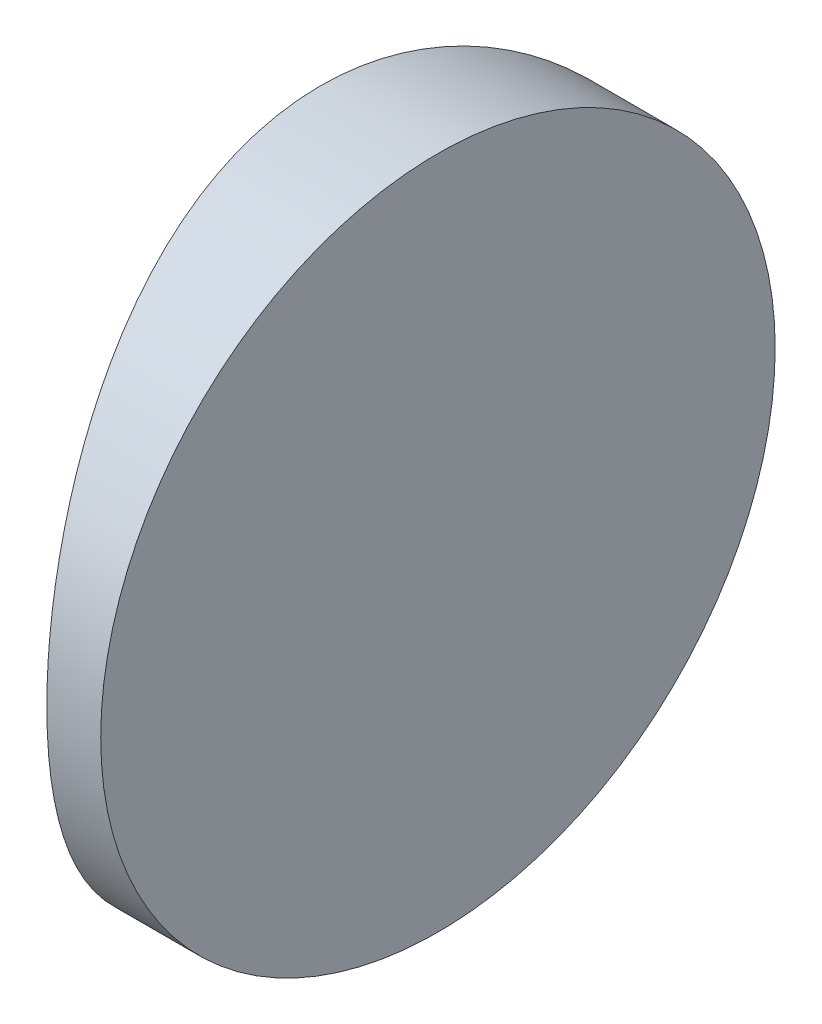
ISO-10303-21;
HEADER;
FILE_DESCRIPTION(('STEP AP214'),'2;1');
FILE_NAME('part.step','',(''),(''),'','','');
FILE_SCHEMA(('AUTOMOTIVE_DESIGN { 1 0 10303 214 1 1 1 1 }'));
ENDSEC;
DATA;
#1=APPLICATION_CONTEXT('core data for automotive mechanical design processes');
#2=APPLICATION_PROTOCOL_DEFINITION('international standard','automotive_design',2000,#1);
#3=PRODUCT_CONTEXT('',#1,'mechanical');
#4=PRODUCT('Part','Part','',(#3));
#5=PRODUCT_RELATED_PRODUCT_CATEGORY('part','',(#4));
#6=PRODUCT_DEFINITION_FORMATION('','',#4);
#7=PRODUCT_DEFINITION_CONTEXT('part definition',#1,'design');
#8=PRODUCT_DEFINITION('design','',#6,#7);
#9=PRODUCT_DEFINITION_SHAPE('','',#8);
#10=(LENGTH_UNIT() NAMED_UNIT(*) SI_UNIT(.MILLI.,.METRE.));
#11=(NAMED_UNIT(*) PLANE_ANGLE_UNIT() SI_UNIT($,.RADIAN.));
#12=(NAMED_UNIT(*) SI_UNIT($,.STERADIAN.) SOLID_ANGLE_UNIT());
#13=UNCERTAINTY_MEASURE_WITH_UNIT(LENGTH_MEASURE(1.E-05),#10,'distance_accuracy_value','');
#14=(GEOMETRIC_REPRESENTATION_CONTEXT(3) GLOBAL_UNCERTAINTY_ASSIGNED_CONTEXT((#13)) GLOBAL_UNIT_ASSIGNED_CONTEXT((#10,
#11,#12)) REPRESENTATION_CONTEXT('',''));
#15=CARTESIAN_POINT('',(0.,0.,0.));
#16=DIRECTION('',(0.,0.,1.));
#17=DIRECTION('',(1.,0.,0.));
#18=AXIS2_PLACEMENT_3D('',#15,#16,#17);
#19=CARTESIAN_POINT('',(4.35520433485127,25.,0.));
#20=DIRECTION('',(0.,-1.,0.));
#21=DIRECTION('',(0.,0.,-1.));
#22=AXIS2_PLACEMENT_3D('',#19,#20,#21);
#23=CYLINDRICAL_SURFACE('',#22,34.39);
#24=CARTESIAN_POINT('',(-30.0347956651487,0.,0.));
#25=CARTESIAN_POINT('',(-30.0347941738012,2.05808691288381E-06,-0.338969365276716));
#26=CARTESIAN_POINT('',(-30.02977143855,0.0138022747202658,-0.677981251628454));
#27=CARTESIAN_POINT('',(-30.0098124018236,0.068873026789289,-1.35350339835082));
#28=CARTESIAN_POINT('',(-29.9948744297759,0.110148191355304,-1.69001322749849));
#29=CARTESIAN_POINT('',(-29.9554754838055,0.219801766105438,-2.35827418334867));
#30=CARTESIAN_POINT('',(-29.9310075652602,0.28819994191662,-2.69002165643485));
#31=CARTESIAN_POINT('',(-29.8732045955471,0.451444175512813,-3.34613046644533));
#32=CARTESIAN_POINT('',(-29.8398698661614,0.546289273528378,-3.67049207094381));
#33=CARTESIAN_POINT('',(-29.7652923573491,0.761331644796709,-4.30892983814302));
#34=CARTESIAN_POINT('',(-29.7240675282049,0.881471432571458,-4.62302748831512));
#35=CARTESIAN_POINT('',(-29.6347161111766,1.14622912634876,-5.23970328918754));
#36=CARTESIAN_POINT('',(-29.5865894736583,1.29084720838819,-5.54228135702505));
#37=CARTESIAN_POINT('',(-29.4846490443849,1.6034228674638,-6.1340495959587));
#38=CARTESIAN_POINT('',(-29.4308362577773,1.77137632112526,-6.4232421202796));
#39=CARTESIAN_POINT('',(-29.3188191212244,2.12952792923171,-6.9867600635451));
#40=CARTESIAN_POINT('',(-29.2606130718088,2.31973470786717,-7.26107965787024));
#41=CARTESIAN_POINT('',(-29.1390989435598,2.72832440355008,-7.80279094983721));
#42=CARTESIAN_POINT('',(-29.0756827269485,2.94747356927273,-8.06958063635612));
#43=CARTESIAN_POINT('',(-28.9472968399626,3.40697185225098,-8.58404643079141));
#44=CARTESIAN_POINT('',(-28.8823264725477,3.64733061711824,-8.83171374347192));
#45=CARTESIAN_POINT('',(-28.7525340809389,4.1478343613551,-9.30646841225841));
#46=CARTESIAN_POINT('',(-28.6877121374308,4.40798826908987,-9.53354637936853));
#47=CARTESIAN_POINT('',(-28.5600091467937,4.94635715716218,-9.96551752073312));
#48=CARTESIAN_POINT('',(-28.4971272586666,5.22456414460021,-10.1704204071195));
#49=CARTESIAN_POINT('',(-28.372789943311,5.80794350109248,-10.5638341865828));
#50=CARTESIAN_POINT('',(-28.3114688618502,6.1137277904784,-10.7514815842722));
#51=CARTESIAN_POINT('',(-28.1946479565188,6.74103459297039,-11.1001362795243));
#52=CARTESIAN_POINT('',(-28.1391458232706,7.06255078764978,-11.2611541603603));
#53=CARTESIAN_POINT('',(-28.0357680589081,7.71900105427024,-11.5551408353397));
#54=CARTESIAN_POINT('',(-27.98788574424,8.05392304123946,-11.6881342440916));
#55=CARTESIAN_POINT('',(-27.9013167412682,8.73502578119687,-11.9249688682733));
#56=CARTESIAN_POINT('',(-27.8626276283538,9.08120353815058,-12.0288177715732));
#57=CARTESIAN_POINT('',(-27.8054007548305,9.68143100554807,-12.1808088297934));
#58=CARTESIAN_POINT('',(-27.7842668773496,9.9333793917823,-12.2363838686093));
#59=CARTESIAN_POINT('',(-27.747742080805,10.4406263719365,-12.3318919628501));
#60=CARTESIAN_POINT('',(-27.732350559544,10.695924611651,-12.37182665849));
#61=CARTESIAN_POINT('',(-27.7076039957435,11.2088044958382,-12.435819302021));
#62=CARTESIAN_POINT('',(-27.6982491686427,11.4663862214718,-12.4598766832805));
#63=CARTESIAN_POINT('',(-27.685756339863,11.9826370420057,-12.4919663580624));
#64=CARTESIAN_POINT('',(-27.6826171850375,12.2413059262884,-12.5000016240484));
#65=CARTESIAN_POINT('',(-27.6826205069228,12.8381375291856,-12.4999978772157));
#66=CARTESIAN_POINT('',(-27.687988080227,13.1763180943923,-12.4862647655251));
#67=CARTESIAN_POINT('',(-27.7092859809318,13.850153005475,-12.4314681749981));
#68=CARTESIAN_POINT('',(-27.7252181196198,14.1858069081745,-12.3904000095811));
#69=CARTESIAN_POINT('',(-27.7671379407654,14.8523361122904,-12.2813125577776));
#70=CARTESIAN_POINT('',(-27.7931334617728,15.1832074795858,-12.2132722613178));
#71=CARTESIAN_POINT('',(-27.8543463007269,15.837540268571,-12.0509111486494));
#72=CARTESIAN_POINT('',(-27.8895633054551,16.1610019415342,-11.9565912250526));
#73=CARTESIAN_POINT('',(-27.9680273574752,16.797524204096,-11.7428151462785));
#74=CARTESIAN_POINT('',(-28.0112528401626,17.1106101248843,-11.6234263820394));
#75=CARTESIAN_POINT('',(-28.1045235765738,17.725337864961,-11.3603532710375));
#76=CARTESIAN_POINT('',(-28.1545688777051,18.0269796046778,-11.2166687553834));
#77=CARTESIAN_POINT('',(-28.2600651870949,18.6170227642194,-10.9061070386771));
#78=CARTESIAN_POINT('',(-28.3155154348455,18.9054260383991,-10.7392330991118));
#79=CARTESIAN_POINT('',(-28.4303590918275,19.4675545532789,-10.3833470017479));
#80=CARTESIAN_POINT('',(-28.4897540285481,19.741274032978,-10.1943262462034));
#81=CARTESIAN_POINT('',(-28.6134801873845,20.2836156031544,-9.78698716485049));
#82=CARTESIAN_POINT('',(-28.6779139612507,20.5515409938053,-9.56777188441143));
#83=CARTESIAN_POINT('',(-28.8076564014561,21.0683037733915,-9.1079010604703));
#84=CARTESIAN_POINT('',(-28.8729654553541,21.3171323549605,-8.86723573357761));
#85=CARTESIAN_POINT('',(-29.0027213743524,21.7941821692289,-8.36588024178535));
#86=CARTESIAN_POINT('',(-29.0671679029777,22.0223955486004,-8.10518251498056));
#87=CARTESIAN_POINT('',(-29.1934522715714,22.4565752778307,-7.56548101808777));
#88=CARTESIAN_POINT('',(-29.2552912656805,22.6625515345815,-7.28648548967727));
#89=CARTESIAN_POINT('',(-29.3767191021934,23.0573190959903,-6.70233462666185));
#90=CARTESIAN_POINT('',(-29.4361688688446,23.2453312639972,-6.39662298665111));
#91=CARTESIAN_POINT('',(-29.5488889743554,23.5947187906965,-5.76940404096194));
#92=CARTESIAN_POINT('',(-29.6021617667492,23.7561047363448,-5.44790307964174));
#93=CARTESIAN_POINT('',(-29.7009854254112,24.0508104644883,-4.79146306772125));
#94=CARTESIAN_POINT('',(-29.7465426456443,24.1841533632267,-4.45653535829633));
#95=CARTESIAN_POINT('',(-29.8286445052507,24.4216551711053,-3.77546339493251));
#96=CARTESIAN_POINT('',(-29.8651914294287,24.5258214796745,-3.42932200976544));
#97=CARTESIAN_POINT('',(-29.9192239767809,24.6785814276123,-2.82826750935797));
#98=CARTESIAN_POINT('',(-29.9391743184519,24.734554021432,-2.57542308425451));
#99=CARTESIAN_POINT('',(-29.9736050265767,24.8307372103584,-2.06639409243557));
#100=CARTESIAN_POINT('',(-29.9880859410891,24.870949384738,-1.81020986304474));
#101=CARTESIAN_POINT('',(-30.011348655705,24.9353837118965,-1.29556512868129));
#102=CARTESIAN_POINT('',(-30.0201301201079,24.9596049228008,-1.03710449053563));
#103=CARTESIAN_POINT('',(-30.0318536561941,24.9919123637648,-0.519104073687481));
#104=CARTESIAN_POINT('',(-30.0347968071425,25.0000015759722,-0.259564503326491));
#105=CARTESIAN_POINT('',(-30.0347941738012,24.9999979419131,0.338969365276735));
#106=CARTESIAN_POINT('',(-30.02977143855,24.9861977252797,0.677981251628475));
#107=CARTESIAN_POINT('',(-30.0098124018236,24.9311269732107,1.35350339835084));
#108=CARTESIAN_POINT('',(-29.9948744297758,24.8898518086447,1.69001322749851));
#109=CARTESIAN_POINT('',(-29.9554754838055,24.7801982338946,2.35827418334869));
#110=CARTESIAN_POINT('',(-29.9310075652602,24.7118000580834,2.69002165643487));
#111=CARTESIAN_POINT('',(-29.8732045955471,24.5485558244872,3.34613046644536));
#112=CARTESIAN_POINT('',(-29.8398698661614,24.4537107264716,3.67049207094383));
#113=CARTESIAN_POINT('',(-29.7652923573491,24.2386683552033,4.30892983814303));
#114=CARTESIAN_POINT('',(-29.7240675282049,24.1185285674285,4.62302748831514));
#115=CARTESIAN_POINT('',(-29.6347161111766,23.8537708736512,5.23970328918756));
#116=CARTESIAN_POINT('',(-29.5865894736583,23.7091527916118,5.54228135702507));
#117=CARTESIAN_POINT('',(-29.4846490443849,23.3965771325362,6.13404959595872));
#118=CARTESIAN_POINT('',(-29.4308362577773,23.2286236788747,6.42324212027962));
#119=CARTESIAN_POINT('',(-29.3188191212244,22.8704720707683,6.98676006354512));
#120=CARTESIAN_POINT('',(-29.2606130718088,22.6802652921328,7.26107965787026));
#121=CARTESIAN_POINT('',(-29.1390989435598,22.2716755964499,7.80279094983723));
#122=CARTESIAN_POINT('',(-29.0756827269485,22.0525264307273,8.06958063635614));
#123=CARTESIAN_POINT('',(-28.9472968399626,21.593028147749,8.58404643079143));
#124=CARTESIAN_POINT('',(-28.8823264725477,21.3526693828818,8.83171374347194));
#125=CARTESIAN_POINT('',(-28.7525340809389,20.8521656386449,9.30646841225843));
#126=CARTESIAN_POINT('',(-28.6877121374308,20.5920117309101,9.53354637936855));
#127=CARTESIAN_POINT('',(-28.5600091467937,20.0536428428378,9.96551752073314));
#128=CARTESIAN_POINT('',(-28.4971272586666,19.7754358553998,10.1704204071195));
#129=CARTESIAN_POINT('',(-28.372789943311,19.1920564989075,10.5638341865828));
#130=CARTESIAN_POINT('',(-28.3114688618502,18.8862722095216,10.7514815842722));
#131=CARTESIAN_POINT('',(-28.1946479565188,18.2589654070296,11.1001362795243));
#132=CARTESIAN_POINT('',(-28.1391458232705,17.9374492123502,11.2611541603603));
#133=CARTESIAN_POINT('',(-28.0357680589081,17.2809989457297,11.5551408353397));
#134=CARTESIAN_POINT('',(-27.98788574424,16.9460769587605,11.6881342440916));
#135=CARTESIAN_POINT('',(-27.9013167412682,16.2649742188031,11.9249688682733));
#136=CARTESIAN_POINT('',(-27.8626276283538,15.9187964618494,12.0288177715732));
#137=CARTESIAN_POINT('',(-27.8054007548305,15.3185689944519,12.1808088297934));
#138=CARTESIAN_POINT('',(-27.7842668773496,15.0666206082177,12.2363838686093));
#139=CARTESIAN_POINT('',(-27.747742080805,14.5593736280635,12.3318919628501));
#140=CARTESIAN_POINT('',(-27.7323505595439,14.304075388349,12.37182665849));
#141=CARTESIAN_POINT('',(-27.7076039957435,13.7911955041618,12.435819302021));
#142=CARTESIAN_POINT('',(-27.6982491686426,13.5336137785282,12.4598766832805));
#143=CARTESIAN_POINT('',(-27.6857563398629,13.0173629579943,12.4919663580624));
#144=CARTESIAN_POINT('',(-27.6826171850375,12.7586940737116,12.5000016240485));
#145=CARTESIAN_POINT('',(-27.6826205069228,12.1618624708144,12.4999978772157));
#146=CARTESIAN_POINT('',(-27.687988080227,11.8236819056077,12.4862647655251));
#147=CARTESIAN_POINT('',(-27.7092859809318,11.149846994525,12.4314681749981));
#148=CARTESIAN_POINT('',(-27.7252181196198,10.8141930918255,12.3904000095811));
#149=CARTESIAN_POINT('',(-27.7671379407654,10.1476638877096,12.2813125577776));
#150=CARTESIAN_POINT('',(-27.7931334617728,9.81679252041423,12.2132722613178));
#151=CARTESIAN_POINT('',(-27.8543463007269,9.16245973142898,12.0509111486494));
#152=CARTESIAN_POINT('',(-27.8895633054551,8.8389980584658,11.9565912250526));
#153=CARTESIAN_POINT('',(-27.9680273574752,8.20247579590404,11.7428151462785));
#154=CARTESIAN_POINT('',(-28.0112528401626,7.88938987511573,11.6234263820395));
#155=CARTESIAN_POINT('',(-28.1045235765738,7.27466213503898,11.3603532710375));
#156=CARTESIAN_POINT('',(-28.1545688777051,6.97302039532227,11.2166687553834));
#157=CARTESIAN_POINT('',(-28.2600651870949,6.38297723578059,10.9061070386772));
#158=CARTESIAN_POINT('',(-28.3155154348454,6.09457396160094,10.7392330991118));
#159=CARTESIAN_POINT('',(-28.4303590918275,5.53244544672111,10.3833470017479));
#160=CARTESIAN_POINT('',(-28.4897540285481,5.25872596702204,10.1943262462034));
#161=CARTESIAN_POINT('',(-28.6134801873845,4.71638439684562,9.78698716485051));
#162=CARTESIAN_POINT('',(-28.6779139612507,4.44845900619468,9.56777188441145));
#163=CARTESIAN_POINT('',(-28.8076564014561,3.93169622660855,9.10790106047032));
#164=CARTESIAN_POINT('',(-28.8729654553541,3.68286764503945,8.86723573357762));
#165=CARTESIAN_POINT('',(-29.0027213743524,3.20581783077114,8.36588024178537));
#166=CARTESIAN_POINT('',(-29.0671679029777,2.97760445139956,8.10518251498058));
#167=CARTESIAN_POINT('',(-29.1934522715714,2.54342472216929,7.56548101808779));
#168=CARTESIAN_POINT('',(-29.2552912656805,2.33744846541853,7.28648548967729));
#169=CARTESIAN_POINT('',(-29.3767191021933,1.9426809040097,6.70233462666187));
#170=CARTESIAN_POINT('',(-29.4361688688446,1.75466873600285,6.39662298665113));
#171=CARTESIAN_POINT('',(-29.5488889743554,1.40528120930348,5.76940404096195));
#172=CARTESIAN_POINT('',(-29.6021617667492,1.24389526365518,5.44790307964176));
#173=CARTESIAN_POINT('',(-29.7009854254112,0.949189535511685,4.79146306772126));
#174=CARTESIAN_POINT('',(-29.7465426456443,0.815846636773263,4.45653535829635));
#175=CARTESIAN_POINT('',(-29.8286445052507,0.578344828894687,3.77546339493253));
#176=CARTESIAN_POINT('',(-29.8651914294287,0.474178520325496,3.42932200976546));
#177=CARTESIAN_POINT('',(-29.9192239767809,0.321418572387698,2.82826750935799));
#178=CARTESIAN_POINT('',(-29.9391743184519,0.265445978567989,2.57542308425453));
#179=CARTESIAN_POINT('',(-29.9736050265767,0.1692627896416,2.06639409243559));
#180=CARTESIAN_POINT('',(-29.9880859410891,0.129050615262026,1.81020986304476));
#181=CARTESIAN_POINT('',(-30.011348655705,0.0646162881035149,1.29556512868131));
#182=CARTESIAN_POINT('',(-30.0201301201079,0.0403950771991752,1.03710449053565));
#183=CARTESIAN_POINT('',(-30.031853656194,0.00808763623515877,0.519104073687496));
#184=CARTESIAN_POINT('',(-30.0347968071425,-1.57597224169272E-06,0.259564503326507));
#185=CARTESIAN_POINT('',(-30.0347956651487,0.,0.));
#186=B_SPLINE_CURVE_WITH_KNOTS('',3,(#24,#25,#26,#27,#28,#29,#30,#31,#32,#33,#34,#35,#36,#37,
#38,#39,#40,#41,#42,#43,#44,#45,#46,#47,#48,#49,#50,#51,#52,#53,#54,#55,#56,#57,#58,#59,#60,#61,
#62,#63,#64,#65,#66,#67,#68,#69,#70,#71,#72,#73,#74,#75,#76,#77,#78,#79,#80,#81,#82,#83,#84,#85,
#86,#87,#88,#89,#90,#91,#92,#93,#94,#95,#96,#97,#98,#99,#100,#101,#102,#103,#104,#105,#106,#107,
#108,#109,#110,#111,#112,#113,#114,#115,#116,#117,#118,#119,#120,#121,#122,#123,#124,#125,#126,
#127,#128,#129,#130,#131,#132,#133,#134,#135,#136,#137,#138,#139,#140,#141,#142,#143,#144,#145,
#146,#147,#148,#149,#150,#151,#152,#153,#154,#155,#156,#157,#158,#159,#160,#161,#162,#163,#164,
#165,#166,#167,#168,#169,#170,#171,#172,#173,#174,#175,#176,#177,#178,#179,#180,#181,#182,#183,
#184,#185),.UNSPECIFIED.,.T.,.F.,(4,2,2,2,2,2,2,2,2,2,2,2,2,2,2,2,2,2,2,2,2,2,2,2,2,2,2,2,2,2,2,
2,2,2,2,2,2,2,2,2,2,2,2,2,2,2,2,2,2,2,2,2,2,2,2,2,2,2,2,2,2,2,2,2,2,2,2,2,2,2,2,2,2,2,2,2,2,2,2,
2,4),(0.,1.01666531110909,2.03350195895287,3.05108098227529,4.06862308205056,5.0838771753111,
6.09913857013201,7.11422079524674,8.12969772286866,9.18162088073061,10.2340250180834,
11.286906676154,12.3393253160311,13.4298951565186,14.5200305287553,15.6092043790699,
16.69809065153,17.4741832063561,18.2501943499448,19.0262331864124,19.8021280367727,
20.8162957130726,21.8306373126841,22.8457705961487,23.8608694038785,24.8732735447774,
25.8856847236622,26.8979536553713,27.9106168762436,28.9658035993395,30.0214740815276,
31.0775450384963,32.1331435451654,33.2231546971548,34.3127313955833,35.4014063907773,
36.489805038317,37.2684887828891,38.0470944794919,38.8257460322132,39.6042536307151,
40.6209189418242,41.637755589668,42.6553346129904,43.6728767127657,44.6881308060262,
45.7033922008471,46.7184744259619,47.7339513535838,48.7858745114457,49.8382786487985,
50.8911603068692,51.9435789467462,53.0341487872338,54.1242841594705,55.2134580097851,
56.3023442822451,57.0784368370712,57.8544479806599,58.6304868171275,59.4063816674878,
60.4205493437877,61.4348909433992,62.4500242268639,63.4651230345936,64.4775271754925,
65.4899383543773,66.5022072860865,67.5148705069587,68.5700572300547,69.6257277122428,
70.6817986692115,71.7373971758806,72.8274083278699,73.9169850262985,75.0056600214924,
76.0940586690321,76.8727424136042,77.651348110207,78.4299996629283,79.2085072614303),.UNSPECIFIED.);
#187=CARTESIAN_POINT('',(-30.0347956651487,0.,0.));
#188=VERTEX_POINT('',#187);
#189=EDGE_CURVE('E10',#188,#188,#186,.T.);
#190=ORIENTED_EDGE('',*,*,#189,.F.);
#191=EDGE_LOOP('',(#190));
#192=FACE_BOUND('',#191,.T.);
#193=ADVANCED_FACE('F35',(#192),#23,.T.);
#194=CARTESIAN_POINT('',(-25.6847956651487,25.,-12.5));
#195=DIRECTION('',(1.,0.,0.));
#196=DIRECTION('',(0.,0.,-1.));
#197=AXIS2_PLACEMENT_3D('',#194,#195,#196);
#198=PLANE('',#197);
#199=CARTESIAN_POINT('',(-25.6847956651487,12.5,0.));
#200=DIRECTION('',(1.,0.,0.));
#201=DIRECTION('',(0.,0.,-1.));
#202=AXIS2_PLACEMENT_3D('',#199,#200,#201);
#203=CIRCLE('',#202,12.5);
#204=CARTESIAN_POINT('',(-25.6847956651487,12.5,-12.5));
#205=VERTEX_POINT('',#204);
#206=EDGE_CURVE('E45',#205,#205,#203,.T.);
#207=ORIENTED_EDGE('',*,*,#206,.T.);
#208=EDGE_LOOP('',(#207));
#209=FACE_BOUND('',#208,.T.);
#210=ADVANCED_FACE('F37',(#209),#198,.T.);
#211=CARTESIAN_POINT('',(-38.3847956651487,12.5,0.));
#212=DIRECTION('',(1.,0.,0.));
#213=DIRECTION('',(0.,0.,-1.));
#214=AXIS2_PLACEMENT_3D('',#211,#212,#213);
#215=CYLINDRICAL_SURFACE('',#214,12.5);
#216=ORIENTED_EDGE('',*,*,#206,.F.);
#217=EDGE_LOOP('',(#216));
#218=FACE_BOUND('',#217,.T.);
#219=ORIENTED_EDGE('',*,*,#189,.T.);
#220=EDGE_LOOP('',(#219));
#221=FACE_BOUND('',#220,.T.);
#222=ADVANCED_FACE('F52',(#218,#221),#215,.T.);
#223=CLOSED_SHELL('',(#193,#210,#222));
#224=MANIFOLD_SOLID_BREP('B2',#223);
#225=ADVANCED_BREP_SHAPE_REPRESENTATION('',(#18,#224),#14);
#226=SHAPE_DEFINITION_REPRESENTATION(#9,#225);
ENDSEC;
END-ISO-10303-21;
